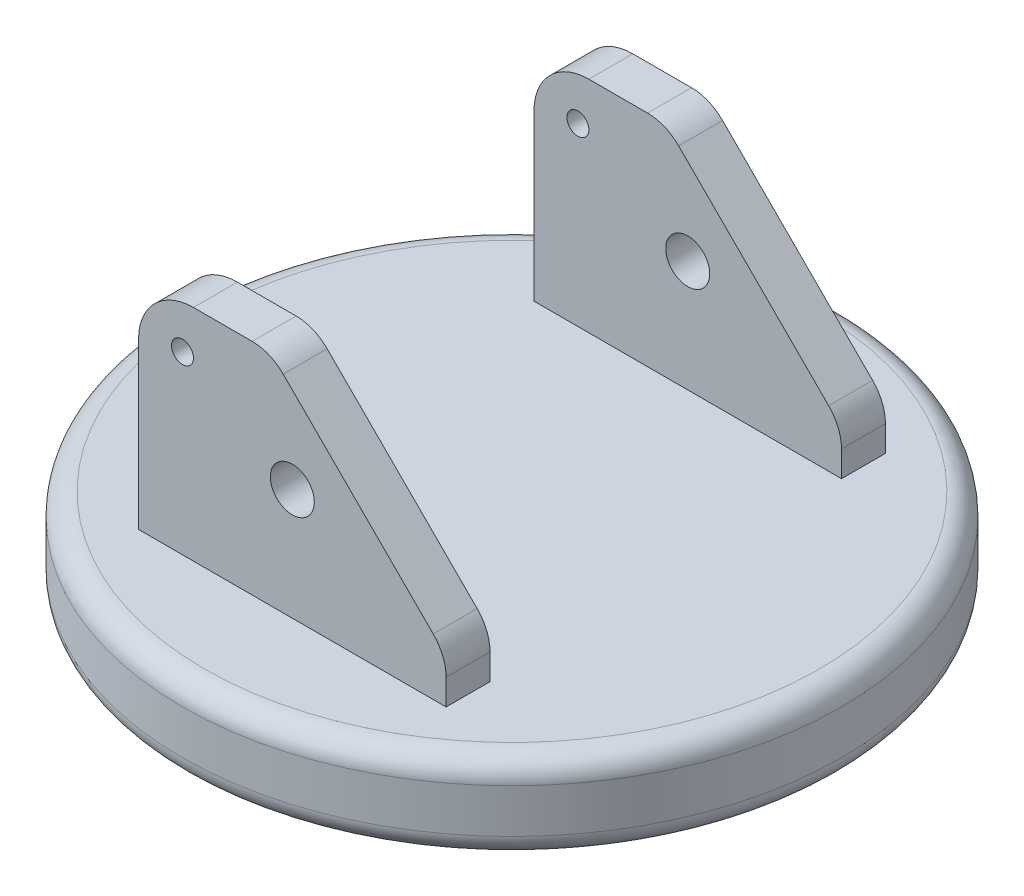
ISO-10303-21;
HEADER;
FILE_DESCRIPTION(('STEP AP214'),'2;1');
FILE_NAME('part.step','',(''),(''),'','','');
FILE_SCHEMA(('AUTOMOTIVE_DESIGN { 1 0 10303 214 1 1 1 1 }'));
ENDSEC;
DATA;
#1=APPLICATION_CONTEXT('core data for automotive mechanical design processes');
#2=APPLICATION_PROTOCOL_DEFINITION('international standard','automotive_design',2000,#1);
#3=PRODUCT_CONTEXT('',#1,'mechanical');
#4=PRODUCT('Part','Part','',(#3));
#5=PRODUCT_RELATED_PRODUCT_CATEGORY('part','',(#4));
#6=PRODUCT_DEFINITION_FORMATION('','',#4);
#7=PRODUCT_DEFINITION_CONTEXT('part definition',#1,'design');
#8=PRODUCT_DEFINITION('design','',#6,#7);
#9=PRODUCT_DEFINITION_SHAPE('','',#8);
#10=(LENGTH_UNIT() NAMED_UNIT(*) SI_UNIT(.MILLI.,.METRE.));
#11=(NAMED_UNIT(*) PLANE_ANGLE_UNIT() SI_UNIT($,.RADIAN.));
#12=(NAMED_UNIT(*) SI_UNIT($,.STERADIAN.) SOLID_ANGLE_UNIT());
#13=UNCERTAINTY_MEASURE_WITH_UNIT(LENGTH_MEASURE(1.E-05),#10,'distance_accuracy_value','');
#14=(GEOMETRIC_REPRESENTATION_CONTEXT(3) GLOBAL_UNCERTAINTY_ASSIGNED_CONTEXT((#13)) GLOBAL_UNIT_ASSIGNED_CONTEXT((#10,
#11,#12)) REPRESENTATION_CONTEXT('',''));
#15=CARTESIAN_POINT('',(0.,0.,0.));
#16=DIRECTION('',(0.,0.,1.));
#17=DIRECTION('',(1.,0.,0.));
#18=AXIS2_PLACEMENT_3D('',#15,#16,#17);
#19=CARTESIAN_POINT('',(0.,40.,0.));
#20=DIRECTION('',(0.,1.,0.));
#21=DIRECTION('',(0.,0.,1.));
#22=AXIS2_PLACEMENT_3D('',#19,#20,#21);
#23=PLANE('',#22);
#24=DIRECTION('',(-1.,0.,0.));
#25=VECTOR('',#24,1.);
#26=CARTESIAN_POINT('',(70.,40.,-100.));
#27=LINE('',#26,#25);
#28=CARTESIAN_POINT('',(70.,40.,-100.));
#29=VERTEX_POINT('',#28);
#30=CARTESIAN_POINT('',(-70.,40.,-100.));
#31=VERTEX_POINT('',#30);
#32=EDGE_CURVE('E195',#29,#31,#27,.T.);
#33=ORIENTED_EDGE('',*,*,#32,.F.);
#34=DIRECTION('',(0.,0.,-1.));
#35=VECTOR('',#34,1.);
#36=CARTESIAN_POINT('',(70.,40.,-100.));
#37=LINE('',#36,#35);
#38=CARTESIAN_POINT('',(70.,40.,-80.));
#39=VERTEX_POINT('',#38);
#40=EDGE_CURVE('E163',#39,#29,#37,.T.);
#41=ORIENTED_EDGE('',*,*,#40,.F.);
#42=DIRECTION('',(1.,0.,0.));
#43=VECTOR('',#42,1.);
#44=CARTESIAN_POINT('',(70.,40.,-80.));
#45=LINE('',#44,#43);
#46=CARTESIAN_POINT('',(-70.,40.,-80.));
#47=VERTEX_POINT('',#46);
#48=EDGE_CURVE('E201',#47,#39,#45,.T.);
#49=ORIENTED_EDGE('',*,*,#48,.F.);
#50=DIRECTION('',(0.,0.,1.));
#51=VECTOR('',#50,1.);
#52=CARTESIAN_POINT('',(-70.,40.,-100.));
#53=LINE('',#52,#51);
#54=EDGE_CURVE('E198',#31,#47,#53,.T.);
#55=ORIENTED_EDGE('',*,*,#54,.F.);
#56=EDGE_LOOP('',(#33,#41,#49,#55));
#57=FACE_BOUND('',#56,.T.);
#58=CARTESIAN_POINT('',(0.,40.,0.));
#59=DIRECTION('',(0.,1.,0.));
#60=DIRECTION('',(0.,0.,1.));
#61=AXIS2_PLACEMENT_3D('',#58,#59,#60);
#62=CIRCLE('',#61,140.);
#63=CARTESIAN_POINT('',(0.,40.,140.));
#64=VERTEX_POINT('',#63);
#65=EDGE_CURVE('E217',#64,#64,#62,.T.);
#66=ORIENTED_EDGE('',*,*,#65,.T.);
#67=EDGE_LOOP('',(#66));
#68=FACE_BOUND('',#67,.T.);
#69=DIRECTION('',(-1.,0.,0.));
#70=VECTOR('',#69,1.);
#71=CARTESIAN_POINT('',(70.,40.,80.));
#72=LINE('',#71,#70);
#73=CARTESIAN_POINT('',(70.,40.,80.));
#74=VERTEX_POINT('',#73);
#75=CARTESIAN_POINT('',(-70.,40.,80.));
#76=VERTEX_POINT('',#75);
#77=EDGE_CURVE('E157',#74,#76,#72,.T.);
#78=ORIENTED_EDGE('',*,*,#77,.F.);
#79=DIRECTION('',(0.,0.,-1.));
#80=VECTOR('',#79,1.);
#81=CARTESIAN_POINT('',(70.,40.,80.));
#82=LINE('',#81,#80);
#83=CARTESIAN_POINT('',(70.,40.,100.));
#84=VERTEX_POINT('',#83);
#85=EDGE_CURVE('E167',#84,#74,#82,.T.);
#86=ORIENTED_EDGE('',*,*,#85,.F.);
#87=DIRECTION('',(1.,0.,0.));
#88=VECTOR('',#87,1.);
#89=CARTESIAN_POINT('',(70.,40.,100.));
#90=LINE('',#89,#88);
#91=CARTESIAN_POINT('',(-70.,40.,100.));
#92=VERTEX_POINT('',#91);
#93=EDGE_CURVE('E179',#92,#84,#90,.T.);
#94=ORIENTED_EDGE('',*,*,#93,.F.);
#95=DIRECTION('',(0.,0.,1.));
#96=VECTOR('',#95,1.);
#97=CARTESIAN_POINT('',(-70.,40.,80.));
#98=LINE('',#97,#96);
#99=EDGE_CURVE('E177',#76,#92,#98,.T.);
#100=ORIENTED_EDGE('',*,*,#99,.F.);
#101=EDGE_LOOP('',(#78,#86,#94,#100));
#102=FACE_BOUND('',#101,.T.);
#103=ADVANCED_FACE('F37',(#57,#68,#102),#23,.T.);
#104=CARTESIAN_POINT('',(0.,40.,0.));
#105=DIRECTION('',(0.,-1.,0.));
#106=DIRECTION('',(0.,0.,-1.));
#107=AXIS2_PLACEMENT_3D('',#104,#105,#106);
#108=CYLINDRICAL_SURFACE('',#107,150.);
#109=CARTESIAN_POINT('',(0.,10.,0.));
#110=DIRECTION('',(0.,1.,0.));
#111=DIRECTION('',(0.,0.,1.));
#112=AXIS2_PLACEMENT_3D('',#109,#110,#111);
#113=CIRCLE('',#112,150.);
#114=CARTESIAN_POINT('',(0.,10.,150.));
#115=VERTEX_POINT('',#114);
#116=EDGE_CURVE('E223',#115,#115,#113,.T.);
#117=ORIENTED_EDGE('',*,*,#116,.T.);
#118=EDGE_LOOP('',(#117));
#119=FACE_BOUND('',#118,.T.);
#120=CARTESIAN_POINT('',(0.,30.,0.));
#121=DIRECTION('',(0.,1.,0.));
#122=DIRECTION('',(0.,0.,1.));
#123=AXIS2_PLACEMENT_3D('',#120,#121,#122);
#124=CIRCLE('',#123,150.);
#125=CARTESIAN_POINT('',(0.,30.,150.));
#126=VERTEX_POINT('',#125);
#127=EDGE_CURVE('E220',#126,#126,#124,.F.);
#128=ORIENTED_EDGE('',*,*,#127,.T.);
#129=EDGE_LOOP('',(#128));
#130=FACE_BOUND('',#129,.T.);
#131=ADVANCED_FACE('F39',(#119,#130),#108,.T.);
#132=CARTESIAN_POINT('',(0.,30.,0.));
#133=DIRECTION('',(0.,1.,0.));
#134=DIRECTION('',(0.,0.,1.));
#135=AXIS2_PLACEMENT_3D('',#132,#133,#134);
#136=TOROIDAL_SURFACE('',#135,140.,10.);
#137=ORIENTED_EDGE('',*,*,#127,.F.);
#138=EDGE_LOOP('',(#137));
#139=FACE_BOUND('',#138,.T.);
#140=ORIENTED_EDGE('',*,*,#65,.F.);
#141=EDGE_LOOP('',(#140));
#142=FACE_BOUND('',#141,.T.);
#143=ADVANCED_FACE('F329',(#139,#142),#136,.T.);
#144=CARTESIAN_POINT('',(0.,10.,0.));
#145=DIRECTION('',(0.,1.,0.));
#146=DIRECTION('',(0.,0.,1.));
#147=AXIS2_PLACEMENT_3D('',#144,#145,#146);
#148=TOROIDAL_SURFACE('',#147,140.,10.);
#149=CARTESIAN_POINT('',(0.,0.,0.));
#150=DIRECTION('',(0.,1.,0.));
#151=DIRECTION('',(0.,0.,1.));
#152=AXIS2_PLACEMENT_3D('',#149,#150,#151);
#153=CIRCLE('',#152,140.);
#154=CARTESIAN_POINT('',(0.,0.,140.));
#155=VERTEX_POINT('',#154);
#156=EDGE_CURVE('E617',#155,#155,#153,.T.);
#157=ORIENTED_EDGE('',*,*,#156,.T.);
#158=EDGE_LOOP('',(#157));
#159=FACE_BOUND('',#158,.T.);
#160=ORIENTED_EDGE('',*,*,#116,.F.);
#161=EDGE_LOOP('',(#160));
#162=FACE_BOUND('',#161,.T.);
#163=ADVANCED_FACE('F336',(#159,#162),#148,.T.);
#164=CARTESIAN_POINT('',(70.,140.,-100.));
#165=DIRECTION('',(-1.,0.,0.));
#166=DIRECTION('',(0.,0.,1.));
#167=AXIS2_PLACEMENT_3D('',#164,#165,#166);
#168=PLANE('',#167);
#169=DIRECTION('',(0.,-1.,0.));
#170=VECTOR('',#169,1.);
#171=CARTESIAN_POINT('',(70.,140.,-100.));
#172=LINE('',#171,#170);
#173=CARTESIAN_POINT('',(70.,51.7157287525379,-100.));
#174=VERTEX_POINT('',#173);
#175=EDGE_CURVE('E215',#174,#29,#172,.T.);
#176=ORIENTED_EDGE('',*,*,#175,.F.);
#177=DIRECTION('',(0.,0.,-1.));
#178=VECTOR('',#177,1.);
#179=CARTESIAN_POINT('',(70.,51.7157287525379,-80.));
#180=LINE('',#179,#178);
#181=CARTESIAN_POINT('',(70.,51.7157287525379,-80.));
#182=VERTEX_POINT('',#181);
#183=EDGE_CURVE('E282',#174,#182,#180,.F.);
#184=ORIENTED_EDGE('',*,*,#183,.T.);
#185=DIRECTION('',(0.,-1.,0.));
#186=VECTOR('',#185,1.);
#187=CARTESIAN_POINT('',(70.,140.,-80.));
#188=LINE('',#187,#186);
#189=EDGE_CURVE('E209',#182,#39,#188,.T.);
#190=ORIENTED_EDGE('',*,*,#189,.T.);
#191=ORIENTED_EDGE('',*,*,#40,.T.);
#192=EDGE_LOOP('',(#176,#184,#190,#191));
#193=FACE_BOUND('',#192,.T.);
#194=ADVANCED_FACE('F340',(#193),#168,.F.);
#195=CARTESIAN_POINT('',(70.,140.,-100.));
#196=DIRECTION('',(0.,0.,1.));
#197=DIRECTION('',(1.,0.,0.));
#198=AXIS2_PLACEMENT_3D('',#195,#196,#197);
#199=PLANE('',#198);
#200=CARTESIAN_POINT('',(-50.,120.,-100.));
#201=DIRECTION('',(0.,0.,-1.));
#202=DIRECTION('',(-1.,0.,0.));
#203=AXIS2_PLACEMENT_3D('',#200,#201,#202);
#204=CIRCLE('',#203,5.);
#205=CARTESIAN_POINT('',(-55.,120.,-100.));
#206=VERTEX_POINT('',#205);
#207=EDGE_CURVE('E256',#206,#206,#204,.T.);
#208=ORIENTED_EDGE('',*,*,#207,.F.);
#209=EDGE_LOOP('',(#208));
#210=FACE_BOUND('',#209,.T.);
#211=CARTESIAN_POINT('',(0.,90.7468879668057,-100.));
#212=DIRECTION('',(0.,0.,1.));
#213=DIRECTION('',(1.,0.,0.));
#214=AXIS2_PLACEMENT_3D('',#211,#212,#213);
#215=CIRCLE('',#214,10.);
#216=CARTESIAN_POINT('',(10.,90.7468879668057,-100.));
#217=VERTEX_POINT('',#216);
#218=EDGE_CURVE('E174',#217,#217,#215,.T.);
#219=ORIENTED_EDGE('',*,*,#218,.T.);
#220=EDGE_LOOP('',(#219));
#221=FACE_BOUND('',#220,.T.);
#222=DIRECTION('',(-1.,0.,0.));
#223=VECTOR('',#222,1.);
#224=CARTESIAN_POINT('',(70.,140.,-100.));
#225=LINE('',#224,#223);
#226=CARTESIAN_POINT('',(-18.2842712474619,140.,-100.));
#227=VERTEX_POINT('',#226);
#228=CARTESIAN_POINT('',(-45.,140.,-100.));
#229=VERTEX_POINT('',#228);
#230=EDGE_CURVE('E204',#227,#229,#225,.T.);
#231=ORIENTED_EDGE('',*,*,#230,.F.);
#232=CARTESIAN_POINT('',(-18.2842712474619,120.,-100.));
#233=DIRECTION('',(0.,0.,1.));
#234=DIRECTION('',(1.,0.,0.));
#235=AXIS2_PLACEMENT_3D('',#232,#233,#234);
#236=CIRCLE('',#235,20.);
#237=CARTESIAN_POINT('',(-4.14213562373096,134.142135623731,-100.));
#238=VERTEX_POINT('',#237);
#239=EDGE_CURVE('E272',#227,#238,#236,.F.);
#240=ORIENTED_EDGE('',*,*,#239,.T.);
#241=DIRECTION('',(-0.707106781186547,0.707106781186548,0.));
#242=VECTOR('',#241,1.);
#243=CARTESIAN_POINT('',(-10.,140.,-100.));
#244=LINE('',#243,#242);
#245=CARTESIAN_POINT('',(64.142135623731,65.8578643762688,-100.));
#246=VERTEX_POINT('',#245);
#247=EDGE_CURVE('E251',#238,#246,#244,.F.);
#248=ORIENTED_EDGE('',*,*,#247,.T.);
#249=CARTESIAN_POINT('',(50.,51.7157287525379,-100.));
#250=DIRECTION('',(0.,0.,1.));
#251=DIRECTION('',(1.,0.,0.));
#252=AXIS2_PLACEMENT_3D('',#249,#250,#251);
#253=CIRCLE('',#252,20.);
#254=EDGE_CURVE('E270',#246,#174,#253,.F.);
#255=ORIENTED_EDGE('',*,*,#254,.T.);
#256=ORIENTED_EDGE('',*,*,#175,.T.);
#257=ORIENTED_EDGE('',*,*,#32,.T.);
#258=DIRECTION('',(0.,-1.,0.));
#259=VECTOR('',#258,1.);
#260=CARTESIAN_POINT('',(-70.,140.,-100.));
#261=LINE('',#260,#259);
#262=CARTESIAN_POINT('',(-70.,115.,-100.));
#263=VERTEX_POINT('',#262);
#264=EDGE_CURVE('E213',#263,#31,#261,.T.);
#265=ORIENTED_EDGE('',*,*,#264,.F.);
#266=CARTESIAN_POINT('',(-45.,115.,-100.));
#267=DIRECTION('',(0.,0.,1.));
#268=DIRECTION('',(1.,0.,0.));
#269=AXIS2_PLACEMENT_3D('',#266,#267,#268);
#270=CIRCLE('',#269,25.);
#271=EDGE_CURVE('E248',#263,#229,#270,.F.);
#272=ORIENTED_EDGE('',*,*,#271,.T.);
#273=EDGE_LOOP('',(#231,#240,#248,#255,#256,#257,#265,#272));
#274=FACE_BOUND('',#273,.T.);
#275=ADVANCED_FACE('F344',(#210,#221,#274),#199,.F.);
#276=CARTESIAN_POINT('',(-70.,140.,-100.));
#277=DIRECTION('',(1.,0.,0.));
#278=DIRECTION('',(0.,0.,-1.));
#279=AXIS2_PLACEMENT_3D('',#276,#277,#278);
#280=PLANE('',#279);
#281=DIRECTION('',(0.,-1.,0.));
#282=VECTOR('',#281,1.);
#283=CARTESIAN_POINT('',(-70.,140.,-80.));
#284=LINE('',#283,#282);
#285=CARTESIAN_POINT('',(-70.,115.,-80.));
#286=VERTEX_POINT('',#285);
#287=EDGE_CURVE('E211',#286,#47,#284,.T.);
#288=ORIENTED_EDGE('',*,*,#287,.F.);
#289=DIRECTION('',(0.,0.,1.));
#290=VECTOR('',#289,1.);
#291=CARTESIAN_POINT('',(-70.,115.,-100.));
#292=LINE('',#291,#290);
#293=EDGE_CURVE('E246',#286,#263,#292,.F.);
#294=ORIENTED_EDGE('',*,*,#293,.T.);
#295=ORIENTED_EDGE('',*,*,#264,.T.);
#296=ORIENTED_EDGE('',*,*,#54,.T.);
#297=EDGE_LOOP('',(#288,#294,#295,#296));
#298=FACE_BOUND('',#297,.T.);
#299=ADVANCED_FACE('F348',(#298),#280,.F.);
#300=CARTESIAN_POINT('',(70.,140.,-80.));
#301=DIRECTION('',(0.,0.,-1.));
#302=DIRECTION('',(-1.,0.,0.));
#303=AXIS2_PLACEMENT_3D('',#300,#301,#302);
#304=PLANE('',#303);
#305=CARTESIAN_POINT('',(-50.,120.,-80.));
#306=DIRECTION('',(0.,0.,-1.));
#307=DIRECTION('',(-1.,0.,0.));
#308=AXIS2_PLACEMENT_3D('',#305,#306,#307);
#309=CIRCLE('',#308,5.);
#310=CARTESIAN_POINT('',(-55.,120.,-80.));
#311=VERTEX_POINT('',#310);
#312=EDGE_CURVE('E231',#311,#311,#309,.T.);
#313=ORIENTED_EDGE('',*,*,#312,.T.);
#314=EDGE_LOOP('',(#313));
#315=FACE_BOUND('',#314,.T.);
#316=CARTESIAN_POINT('',(0.,90.7468879668057,-80.));
#317=DIRECTION('',(0.,0.,-1.));
#318=DIRECTION('',(-1.,0.,0.));
#319=AXIS2_PLACEMENT_3D('',#316,#317,#318);
#320=CIRCLE('',#319,10.);
#321=CARTESIAN_POINT('',(-10.,90.7468879668057,-80.));
#322=VERTEX_POINT('',#321);
#323=EDGE_CURVE('E602',#322,#322,#320,.T.);
#324=ORIENTED_EDGE('',*,*,#323,.T.);
#325=EDGE_LOOP('',(#324));
#326=FACE_BOUND('',#325,.T.);
#327=DIRECTION('',(0.707106781186547,-0.707106781186548,0.));
#328=VECTOR('',#327,1.);
#329=CARTESIAN_POINT('',(-10.,140.,-80.));
#330=LINE('',#329,#328);
#331=CARTESIAN_POINT('',(64.142135623731,65.8578643762688,-80.));
#332=VERTEX_POINT('',#331);
#333=CARTESIAN_POINT('',(-4.14213562373096,134.142135623731,-80.));
#334=VERTEX_POINT('',#333);
#335=EDGE_CURVE('E259',#332,#334,#330,.F.);
#336=ORIENTED_EDGE('',*,*,#335,.T.);
#337=CARTESIAN_POINT('',(-18.2842712474619,120.,-80.));
#338=DIRECTION('',(0.,0.,-1.));
#339=DIRECTION('',(-1.,0.,0.));
#340=AXIS2_PLACEMENT_3D('',#337,#338,#339);
#341=CIRCLE('',#340,20.);
#342=CARTESIAN_POINT('',(-18.2842712474619,140.,-80.));
#343=VERTEX_POINT('',#342);
#344=EDGE_CURVE('E280',#334,#343,#341,.F.);
#345=ORIENTED_EDGE('',*,*,#344,.T.);
#346=DIRECTION('',(1.,0.,0.));
#347=VECTOR('',#346,1.);
#348=CARTESIAN_POINT('',(70.,140.,-80.));
#349=LINE('',#348,#347);
#350=CARTESIAN_POINT('',(-45.,140.,-80.));
#351=VERTEX_POINT('',#350);
#352=EDGE_CURVE('E206',#351,#343,#349,.T.);
#353=ORIENTED_EDGE('',*,*,#352,.F.);
#354=CARTESIAN_POINT('',(-45.,115.,-80.));
#355=DIRECTION('',(0.,0.,-1.));
#356=DIRECTION('',(-1.,0.,0.));
#357=AXIS2_PLACEMENT_3D('',#354,#355,#356);
#358=CIRCLE('',#357,25.);
#359=EDGE_CURVE('E244',#351,#286,#358,.F.);
#360=ORIENTED_EDGE('',*,*,#359,.T.);
#361=ORIENTED_EDGE('',*,*,#287,.T.);
#362=ORIENTED_EDGE('',*,*,#48,.T.);
#363=ORIENTED_EDGE('',*,*,#189,.F.);
#364=CARTESIAN_POINT('',(50.,51.7157287525379,-80.));
#365=DIRECTION('',(0.,0.,-1.));
#366=DIRECTION('',(-1.,0.,0.));
#367=AXIS2_PLACEMENT_3D('',#364,#365,#366);
#368=CIRCLE('',#367,20.);
#369=EDGE_CURVE('E278',#182,#332,#368,.F.);
#370=ORIENTED_EDGE('',*,*,#369,.T.);
#371=EDGE_LOOP('',(#336,#345,#353,#360,#361,#362,#363,#370));
#372=FACE_BOUND('',#371,.T.);
#373=ADVANCED_FACE('F352',(#315,#326,#372),#304,.F.);
#374=CARTESIAN_POINT('',(70.,140.,-80.));
#375=DIRECTION('',(0.,-1.,0.));
#376=DIRECTION('',(0.,0.,-1.));
#377=AXIS2_PLACEMENT_3D('',#374,#375,#376);
#378=PLANE('',#377);
#379=ORIENTED_EDGE('',*,*,#352,.T.);
#380=DIRECTION('',(0.,0.,1.));
#381=VECTOR('',#380,1.);
#382=CARTESIAN_POINT('',(-18.2842712474619,140.,-100.));
#383=LINE('',#382,#381);
#384=EDGE_CURVE('E267',#343,#227,#383,.F.);
#385=ORIENTED_EDGE('',*,*,#384,.T.);
#386=ORIENTED_EDGE('',*,*,#230,.T.);
#387=DIRECTION('',(0.,0.,1.));
#388=VECTOR('',#387,1.);
#389=CARTESIAN_POINT('',(-45.,140.,-80.));
#390=LINE('',#389,#388);
#391=EDGE_CURVE('E241',#229,#351,#390,.T.);
#392=ORIENTED_EDGE('',*,*,#391,.T.);
#393=EDGE_LOOP('',(#379,#385,#386,#392));
#394=FACE_BOUND('',#393,.T.);
#395=ADVANCED_FACE('F356',(#394),#378,.F.);
#396=CARTESIAN_POINT('',(70.,140.,80.));
#397=DIRECTION('',(-1.,0.,0.));
#398=DIRECTION('',(0.,0.,1.));
#399=AXIS2_PLACEMENT_3D('',#396,#397,#398);
#400=PLANE('',#399);
#401=DIRECTION('',(0.,-1.,0.));
#402=VECTOR('',#401,1.);
#403=CARTESIAN_POINT('',(70.,140.,80.));
#404=LINE('',#403,#402);
#405=CARTESIAN_POINT('',(70.,51.7157287525379,80.));
#406=VERTEX_POINT('',#405);
#407=EDGE_CURVE('E152',#406,#74,#404,.T.);
#408=ORIENTED_EDGE('',*,*,#407,.F.);
#409=DIRECTION('',(0.,0.,-1.));
#410=VECTOR('',#409,1.);
#411=CARTESIAN_POINT('',(70.,51.7157287525379,100.));
#412=LINE('',#411,#410);
#413=CARTESIAN_POINT('',(70.,51.7157287525379,100.));
#414=VERTEX_POINT('',#413);
#415=EDGE_CURVE('E285',#406,#414,#412,.F.);
#416=ORIENTED_EDGE('',*,*,#415,.T.);
#417=DIRECTION('',(0.,-1.,0.));
#418=VECTOR('',#417,1.);
#419=CARTESIAN_POINT('',(70.,140.,100.));
#420=LINE('',#419,#418);
#421=EDGE_CURVE('E170',#414,#84,#420,.T.);
#422=ORIENTED_EDGE('',*,*,#421,.T.);
#423=ORIENTED_EDGE('',*,*,#85,.T.);
#424=EDGE_LOOP('',(#408,#416,#422,#423));
#425=FACE_BOUND('',#424,.T.);
#426=ADVANCED_FACE('F168',(#425),#400,.F.);
#427=CARTESIAN_POINT('',(70.,140.,80.));
#428=DIRECTION('',(0.,0.,1.));
#429=DIRECTION('',(1.,0.,0.));
#430=AXIS2_PLACEMENT_3D('',#427,#428,#429);
#431=PLANE('',#430);
#432=CARTESIAN_POINT('',(-50.,120.,80.));
#433=DIRECTION('',(0.,0.,1.));
#434=DIRECTION('',(1.,0.,0.));
#435=AXIS2_PLACEMENT_3D('',#432,#433,#434);
#436=CIRCLE('',#435,5.);
#437=CARTESIAN_POINT('',(-45.,120.,80.));
#438=VERTEX_POINT('',#437);
#439=EDGE_CURVE('E255',#438,#438,#436,.T.);
#440=ORIENTED_EDGE('',*,*,#439,.T.);
#441=EDGE_LOOP('',(#440));
#442=FACE_BOUND('',#441,.T.);
#443=CARTESIAN_POINT('',(0.,90.7468879668057,80.));
#444=DIRECTION('',(0.,0.,1.));
#445=DIRECTION('',(1.,0.,0.));
#446=AXIS2_PLACEMENT_3D('',#443,#444,#445);
#447=CIRCLE('',#446,10.);
#448=CARTESIAN_POINT('',(10.,90.7468879668057,80.));
#449=VERTEX_POINT('',#448);
#450=EDGE_CURVE('E230',#449,#449,#447,.T.);
#451=ORIENTED_EDGE('',*,*,#450,.T.);
#452=EDGE_LOOP('',(#451));
#453=FACE_BOUND('',#452,.T.);
#454=DIRECTION('',(-0.707106781186547,0.707106781186548,0.));
#455=VECTOR('',#454,1.);
#456=CARTESIAN_POINT('',(-10.,140.,80.));
#457=LINE('',#456,#455);
#458=CARTESIAN_POINT('',(-4.14213562373096,134.142135623731,80.));
#459=VERTEX_POINT('',#458);
#460=CARTESIAN_POINT('',(64.142135623731,65.8578643762688,80.));
#461=VERTEX_POINT('',#460);
#462=EDGE_CURVE('E262',#459,#461,#457,.F.);
#463=ORIENTED_EDGE('',*,*,#462,.T.);
#464=CARTESIAN_POINT('',(50.,51.7157287525379,80.));
#465=DIRECTION('',(0.,0.,1.));
#466=DIRECTION('',(1.,0.,0.));
#467=AXIS2_PLACEMENT_3D('',#464,#465,#466);
#468=CIRCLE('',#467,20.);
#469=EDGE_CURVE('E45',#461,#406,#468,.F.);
#470=ORIENTED_EDGE('',*,*,#469,.T.);
#471=ORIENTED_EDGE('',*,*,#407,.T.);
#472=ORIENTED_EDGE('',*,*,#77,.T.);
#473=DIRECTION('',(0.,-1.,0.));
#474=VECTOR('',#473,1.);
#475=CARTESIAN_POINT('',(-70.,140.,80.));
#476=LINE('',#475,#474);
#477=CARTESIAN_POINT('',(-70.,115.,80.));
#478=VERTEX_POINT('',#477);
#479=EDGE_CURVE('E164',#478,#76,#476,.T.);
#480=ORIENTED_EDGE('',*,*,#479,.F.);
#481=CARTESIAN_POINT('',(-45.,115.,80.));
#482=DIRECTION('',(0.,0.,1.));
#483=DIRECTION('',(1.,0.,0.));
#484=AXIS2_PLACEMENT_3D('',#481,#482,#483);
#485=CIRCLE('',#484,25.);
#486=CARTESIAN_POINT('',(-45.,140.,80.));
#487=VERTEX_POINT('',#486);
#488=EDGE_CURVE('E238',#478,#487,#485,.F.);
#489=ORIENTED_EDGE('',*,*,#488,.T.);
#490=DIRECTION('',(-1.,0.,0.));
#491=VECTOR('',#490,1.);
#492=CARTESIAN_POINT('',(70.,140.,80.));
#493=LINE('',#492,#491);
#494=CARTESIAN_POINT('',(-18.2842712474619,140.,80.));
#495=VERTEX_POINT('',#494);
#496=EDGE_CURVE('E184',#495,#487,#493,.T.);
#497=ORIENTED_EDGE('',*,*,#496,.F.);
#498=CARTESIAN_POINT('',(-18.2842712474619,120.,80.));
#499=DIRECTION('',(0.,0.,1.));
#500=DIRECTION('',(1.,0.,0.));
#501=AXIS2_PLACEMENT_3D('',#498,#499,#500);
#502=CIRCLE('',#501,20.);
#503=EDGE_CURVE('E52',#495,#459,#502,.F.);
#504=ORIENTED_EDGE('',*,*,#503,.T.);
#505=EDGE_LOOP('',(#463,#470,#471,#472,#480,#489,#497,#504));
#506=FACE_BOUND('',#505,.T.);
#507=ADVANCED_FACE('F154',(#442,#453,#506),#431,.F.);
#508=CARTESIAN_POINT('',(-70.,140.,80.));
#509=DIRECTION('',(1.,0.,0.));
#510=DIRECTION('',(0.,0.,-1.));
#511=AXIS2_PLACEMENT_3D('',#508,#509,#510);
#512=PLANE('',#511);
#513=DIRECTION('',(0.,-1.,0.));
#514=VECTOR('',#513,1.);
#515=CARTESIAN_POINT('',(-70.,140.,100.));
#516=LINE('',#515,#514);
#517=CARTESIAN_POINT('',(-70.,115.,100.));
#518=VERTEX_POINT('',#517);
#519=EDGE_CURVE('E190',#518,#92,#516,.T.);
#520=ORIENTED_EDGE('',*,*,#519,.F.);
#521=DIRECTION('',(0.,0.,1.));
#522=VECTOR('',#521,1.);
#523=CARTESIAN_POINT('',(-70.,115.,80.));
#524=LINE('',#523,#522);
#525=EDGE_CURVE('E236',#518,#478,#524,.F.);
#526=ORIENTED_EDGE('',*,*,#525,.T.);
#527=ORIENTED_EDGE('',*,*,#479,.T.);
#528=ORIENTED_EDGE('',*,*,#99,.T.);
#529=EDGE_LOOP('',(#520,#526,#527,#528));
#530=FACE_BOUND('',#529,.T.);
#531=ADVANCED_FACE('F310',(#530),#512,.F.);
#532=CARTESIAN_POINT('',(70.,140.,100.));
#533=DIRECTION('',(0.,0.,-1.));
#534=DIRECTION('',(-1.,0.,0.));
#535=AXIS2_PLACEMENT_3D('',#532,#533,#534);
#536=PLANE('',#535);
#537=CARTESIAN_POINT('',(-50.,120.,100.));
#538=DIRECTION('',(0.,0.,-1.));
#539=DIRECTION('',(-1.,0.,0.));
#540=AXIS2_PLACEMENT_3D('',#537,#538,#539);
#541=CIRCLE('',#540,5.);
#542=CARTESIAN_POINT('',(-55.,120.,100.));
#543=VERTEX_POINT('',#542);
#544=EDGE_CURVE('E252',#543,#543,#541,.T.);
#545=ORIENTED_EDGE('',*,*,#544,.T.);
#546=EDGE_LOOP('',(#545));
#547=FACE_BOUND('',#546,.T.);
#548=CARTESIAN_POINT('',(0.,90.7468879668057,100.));
#549=DIRECTION('',(0.,0.,-1.));
#550=DIRECTION('',(-1.,0.,0.));
#551=AXIS2_PLACEMENT_3D('',#548,#549,#550);
#552=CIRCLE('',#551,10.);
#553=CARTESIAN_POINT('',(-10.,90.7468879668057,100.));
#554=VERTEX_POINT('',#553);
#555=EDGE_CURVE('E227',#554,#554,#552,.T.);
#556=ORIENTED_EDGE('',*,*,#555,.T.);
#557=EDGE_LOOP('',(#556));
#558=FACE_BOUND('',#557,.T.);
#559=ORIENTED_EDGE('',*,*,#421,.F.);
#560=CARTESIAN_POINT('',(50.,51.7157287525379,100.));
#561=DIRECTION('',(0.,0.,-1.));
#562=DIRECTION('',(-1.,0.,0.));
#563=AXIS2_PLACEMENT_3D('',#560,#561,#562);
#564=CIRCLE('',#563,20.);
#565=CARTESIAN_POINT('',(64.142135623731,65.8578643762688,100.));
#566=VERTEX_POINT('',#565);
#567=EDGE_CURVE('E289',#414,#566,#564,.F.);
#568=ORIENTED_EDGE('',*,*,#567,.T.);
#569=DIRECTION('',(0.707106781186547,-0.707106781186548,0.));
#570=VECTOR('',#569,1.);
#571=CARTESIAN_POINT('',(-10.,140.,100.));
#572=LINE('',#571,#570);
#573=CARTESIAN_POINT('',(-4.14213562373096,134.142135623731,100.));
#574=VERTEX_POINT('',#573);
#575=EDGE_CURVE('E264',#566,#574,#572,.F.);
#576=ORIENTED_EDGE('',*,*,#575,.T.);
#577=CARTESIAN_POINT('',(-18.2842712474619,120.,100.));
#578=DIRECTION('',(0.,0.,-1.));
#579=DIRECTION('',(-1.,0.,0.));
#580=AXIS2_PLACEMENT_3D('',#577,#578,#579);
#581=CIRCLE('',#580,20.);
#582=CARTESIAN_POINT('',(-18.2842712474619,140.,100.));
#583=VERTEX_POINT('',#582);
#584=EDGE_CURVE('E287',#574,#583,#581,.F.);
#585=ORIENTED_EDGE('',*,*,#584,.T.);
#586=DIRECTION('',(1.,0.,0.));
#587=VECTOR('',#586,1.);
#588=CARTESIAN_POINT('',(70.,140.,100.));
#589=LINE('',#588,#587);
#590=CARTESIAN_POINT('',(-45.,140.,100.));
#591=VERTEX_POINT('',#590);
#592=EDGE_CURVE('E186',#591,#583,#589,.T.);
#593=ORIENTED_EDGE('',*,*,#592,.F.);
#594=CARTESIAN_POINT('',(-45.,115.,100.));
#595=DIRECTION('',(0.,0.,-1.));
#596=DIRECTION('',(-1.,0.,0.));
#597=AXIS2_PLACEMENT_3D('',#594,#595,#596);
#598=CIRCLE('',#597,25.);
#599=EDGE_CURVE('E234',#591,#518,#598,.F.);
#600=ORIENTED_EDGE('',*,*,#599,.T.);
#601=ORIENTED_EDGE('',*,*,#519,.T.);
#602=ORIENTED_EDGE('',*,*,#93,.T.);
#603=EDGE_LOOP('',(#559,#568,#576,#585,#593,#600,#601,#602));
#604=FACE_BOUND('',#603,.T.);
#605=ADVANCED_FACE('F300',(#547,#558,#604),#536,.F.);
#606=CARTESIAN_POINT('',(70.,140.,100.));
#607=DIRECTION('',(0.,-1.,0.));
#608=DIRECTION('',(0.,0.,-1.));
#609=AXIS2_PLACEMENT_3D('',#606,#607,#608);
#610=PLANE('',#609);
#611=ORIENTED_EDGE('',*,*,#592,.T.);
#612=DIRECTION('',(0.,0.,1.));
#613=VECTOR('',#612,1.);
#614=CARTESIAN_POINT('',(-18.2842712474619,140.,80.));
#615=LINE('',#614,#613);
#616=EDGE_CURVE('E11',#583,#495,#615,.F.);
#617=ORIENTED_EDGE('',*,*,#616,.T.);
#618=ORIENTED_EDGE('',*,*,#496,.T.);
#619=DIRECTION('',(0.,0.,1.));
#620=VECTOR('',#619,1.);
#621=CARTESIAN_POINT('',(-45.,140.,100.));
#622=LINE('',#621,#620);
#623=EDGE_CURVE('E226',#487,#591,#622,.T.);
#624=ORIENTED_EDGE('',*,*,#623,.T.);
#625=EDGE_LOOP('',(#611,#617,#618,#624));
#626=FACE_BOUND('',#625,.T.);
#627=ADVANCED_FACE('F302',(#626),#610,.F.);
#628=CARTESIAN_POINT('',(0.,90.7468879668057,-150.));
#629=DIRECTION('',(0.,0.,1.));
#630=DIRECTION('',(1.,0.,0.));
#631=AXIS2_PLACEMENT_3D('',#628,#629,#630);
#632=CYLINDRICAL_SURFACE('',#631,10.);
#633=ORIENTED_EDGE('',*,*,#555,.F.);
#634=EDGE_LOOP('',(#633));
#635=FACE_BOUND('',#634,.T.);
#636=ORIENTED_EDGE('',*,*,#450,.F.);
#637=EDGE_LOOP('',(#636));
#638=FACE_BOUND('',#637,.T.);
#639=ADVANCED_FACE('F373',(#635,#638),#632,.F.);
#640=ORIENTED_EDGE('',*,*,#323,.F.);
#641=EDGE_LOOP('',(#640));
#642=FACE_BOUND('',#641,.T.);
#643=ORIENTED_EDGE('',*,*,#218,.F.);
#644=EDGE_LOOP('',(#643));
#645=FACE_BOUND('',#644,.T.);
#646=ADVANCED_FACE('F374',(#642,#645),#632,.F.);
#647=CARTESIAN_POINT('',(-45.,115.,100.));
#648=DIRECTION('',(0.,0.,1.));
#649=DIRECTION('',(1.,0.,0.));
#650=AXIS2_PLACEMENT_3D('',#647,#648,#649);
#651=CYLINDRICAL_SURFACE('',#650,25.);
#652=ORIENTED_EDGE('',*,*,#488,.F.);
#653=ORIENTED_EDGE('',*,*,#525,.F.);
#654=ORIENTED_EDGE('',*,*,#599,.F.);
#655=ORIENTED_EDGE('',*,*,#623,.F.);
#656=EDGE_LOOP('',(#652,#653,#654,#655));
#657=FACE_BOUND('',#656,.T.);
#658=ADVANCED_FACE('F306',(#657),#651,.T.);
#659=CARTESIAN_POINT('',(-45.,115.,-80.));
#660=DIRECTION('',(0.,0.,1.));
#661=DIRECTION('',(1.,0.,0.));
#662=AXIS2_PLACEMENT_3D('',#659,#660,#661);
#663=CYLINDRICAL_SURFACE('',#662,25.);
#664=ORIENTED_EDGE('',*,*,#271,.F.);
#665=ORIENTED_EDGE('',*,*,#293,.F.);
#666=ORIENTED_EDGE('',*,*,#359,.F.);
#667=ORIENTED_EDGE('',*,*,#391,.F.);
#668=EDGE_LOOP('',(#664,#665,#666,#667));
#669=FACE_BOUND('',#668,.T.);
#670=ADVANCED_FACE('F380',(#669),#663,.T.);
#671=CARTESIAN_POINT('',(-50.,120.,150.));
#672=DIRECTION('',(0.,0.,-1.));
#673=DIRECTION('',(-1.,0.,0.));
#674=AXIS2_PLACEMENT_3D('',#671,#672,#673);
#675=CYLINDRICAL_SURFACE('',#674,5.);
#676=ORIENTED_EDGE('',*,*,#544,.F.);
#677=EDGE_LOOP('',(#676));
#678=FACE_BOUND('',#677,.T.);
#679=ORIENTED_EDGE('',*,*,#439,.F.);
#680=EDGE_LOOP('',(#679));
#681=FACE_BOUND('',#680,.T.);
#682=ADVANCED_FACE('F383',(#678,#681),#675,.F.);
#683=ORIENTED_EDGE('',*,*,#207,.T.);
#684=EDGE_LOOP('',(#683));
#685=FACE_BOUND('',#684,.T.);
#686=ORIENTED_EDGE('',*,*,#312,.F.);
#687=EDGE_LOOP('',(#686));
#688=FACE_BOUND('',#687,.T.);
#689=ADVANCED_FACE('F385',(#685,#688),#675,.F.);
#690=CARTESIAN_POINT('',(0.,30.,0.));
#691=DIRECTION('',(0.,1.,0.));
#692=DIRECTION('',(0.,0.,1.));
#693=AXIS2_PLACEMENT_3D('',#690,#691,#692);
#694=PLANE('',#693);
#695=CARTESIAN_POINT('',(0.,30.,0.));
#696=DIRECTION('',(0.,1.,0.));
#697=DIRECTION('',(0.,0.,1.));
#698=AXIS2_PLACEMENT_3D('',#695,#696,#697);
#699=CIRCLE('',#698,140.);
#700=CARTESIAN_POINT('',(0.,30.,140.));
#701=VERTEX_POINT('',#700);
#702=EDGE_CURVE('E620',#701,#701,#699,.T.);
#703=ORIENTED_EDGE('',*,*,#702,.F.);
#704=EDGE_LOOP('',(#703));
#705=FACE_BOUND('',#704,.T.);
#706=ADVANCED_FACE('F388',(#705),#694,.F.);
#707=CARTESIAN_POINT('',(0.,40.,0.));
#708=DIRECTION('',(0.,-1.,0.));
#709=DIRECTION('',(0.,0.,-1.));
#710=AXIS2_PLACEMENT_3D('',#707,#708,#709);
#711=CYLINDRICAL_SURFACE('',#710,140.);
#712=ORIENTED_EDGE('',*,*,#156,.F.);
#713=EDGE_LOOP('',(#712));
#714=FACE_BOUND('',#713,.T.);
#715=ORIENTED_EDGE('',*,*,#702,.T.);
#716=EDGE_LOOP('',(#715));
#717=FACE_BOUND('',#716,.T.);
#718=ADVANCED_FACE('F390',(#714,#717),#711,.F.);
#719=CARTESIAN_POINT('',(-10.,140.,-80.));
#720=DIRECTION('',(-0.707106781186548,-0.707106781186547,0.));
#721=DIRECTION('',(0.707106781186547,-0.707106781186548,0.));
#722=AXIS2_PLACEMENT_3D('',#719,#720,#721);
#723=PLANE('',#722);
#724=ORIENTED_EDGE('',*,*,#247,.F.);
#725=DIRECTION('',(0.,0.,-1.));
#726=VECTOR('',#725,1.);
#727=CARTESIAN_POINT('',(-4.14213562373096,134.142135623731,-80.));
#728=LINE('',#727,#726);
#729=EDGE_CURVE('E276',#238,#334,#728,.F.);
#730=ORIENTED_EDGE('',*,*,#729,.T.);
#731=ORIENTED_EDGE('',*,*,#335,.F.);
#732=DIRECTION('',(0.,0.,1.));
#733=VECTOR('',#732,1.);
#734=CARTESIAN_POINT('',(64.142135623731,65.8578643762688,-100.));
#735=LINE('',#734,#733);
#736=EDGE_CURVE('E274',#332,#246,#735,.F.);
#737=ORIENTED_EDGE('',*,*,#736,.T.);
#738=EDGE_LOOP('',(#724,#730,#731,#737));
#739=FACE_BOUND('',#738,.T.);
#740=ADVANCED_FACE('F393',(#739),#723,.F.);
#741=CARTESIAN_POINT('',(-10.,140.,100.));
#742=DIRECTION('',(-0.707106781186548,-0.707106781186547,0.));
#743=DIRECTION('',(0.707106781186547,-0.707106781186548,0.));
#744=AXIS2_PLACEMENT_3D('',#741,#742,#743);
#745=PLANE('',#744);
#746=ORIENTED_EDGE('',*,*,#575,.F.);
#747=DIRECTION('',(0.,0.,1.));
#748=VECTOR('',#747,1.);
#749=CARTESIAN_POINT('',(64.142135623731,65.8578643762688,80.));
#750=LINE('',#749,#748);
#751=EDGE_CURVE('E59',#566,#461,#750,.F.);
#752=ORIENTED_EDGE('',*,*,#751,.T.);
#753=ORIENTED_EDGE('',*,*,#462,.F.);
#754=DIRECTION('',(0.,0.,-1.));
#755=VECTOR('',#754,1.);
#756=CARTESIAN_POINT('',(-4.14213562373096,134.142135623731,100.));
#757=LINE('',#756,#755);
#758=EDGE_CURVE('E291',#459,#574,#757,.F.);
#759=ORIENTED_EDGE('',*,*,#758,.T.);
#760=EDGE_LOOP('',(#746,#752,#753,#759));
#761=FACE_BOUND('',#760,.T.);
#762=ADVANCED_FACE('F295',(#761),#745,.F.);
#763=CARTESIAN_POINT('',(-18.2842712474619,120.,-80.));
#764=DIRECTION('',(0.,0.,-1.));
#765=DIRECTION('',(-1.,0.,0.));
#766=AXIS2_PLACEMENT_3D('',#763,#764,#765);
#767=CYLINDRICAL_SURFACE('',#766,20.);
#768=ORIENTED_EDGE('',*,*,#344,.F.);
#769=ORIENTED_EDGE('',*,*,#729,.F.);
#770=ORIENTED_EDGE('',*,*,#239,.F.);
#771=ORIENTED_EDGE('',*,*,#384,.F.);
#772=EDGE_LOOP('',(#768,#769,#770,#771));
#773=FACE_BOUND('',#772,.T.);
#774=ADVANCED_FACE('F321',(#773),#767,.T.);
#775=CARTESIAN_POINT('',(50.,51.7157287525379,-100.));
#776=DIRECTION('',(0.,0.,1.));
#777=DIRECTION('',(1.,0.,0.));
#778=AXIS2_PLACEMENT_3D('',#775,#776,#777);
#779=CYLINDRICAL_SURFACE('',#778,20.);
#780=ORIENTED_EDGE('',*,*,#254,.F.);
#781=ORIENTED_EDGE('',*,*,#736,.F.);
#782=ORIENTED_EDGE('',*,*,#369,.F.);
#783=ORIENTED_EDGE('',*,*,#183,.F.);
#784=EDGE_LOOP('',(#780,#781,#782,#783));
#785=FACE_BOUND('',#784,.T.);
#786=ADVANCED_FACE('F314',(#785),#779,.T.);
#787=CARTESIAN_POINT('',(50.,51.7157287525379,80.));
#788=DIRECTION('',(0.,0.,1.));
#789=DIRECTION('',(1.,0.,0.));
#790=AXIS2_PLACEMENT_3D('',#787,#788,#789);
#791=CYLINDRICAL_SURFACE('',#790,20.);
#792=ORIENTED_EDGE('',*,*,#469,.F.);
#793=ORIENTED_EDGE('',*,*,#751,.F.);
#794=ORIENTED_EDGE('',*,*,#567,.F.);
#795=ORIENTED_EDGE('',*,*,#415,.F.);
#796=EDGE_LOOP('',(#792,#793,#794,#795));
#797=FACE_BOUND('',#796,.T.);
#798=ADVANCED_FACE('F312',(#797),#791,.T.);
#799=CARTESIAN_POINT('',(-18.2842712474619,120.,100.));
#800=DIRECTION('',(0.,0.,-1.));
#801=DIRECTION('',(-1.,0.,0.));
#802=AXIS2_PLACEMENT_3D('',#799,#800,#801);
#803=CYLINDRICAL_SURFACE('',#802,20.);
#804=ORIENTED_EDGE('',*,*,#584,.F.);
#805=ORIENTED_EDGE('',*,*,#758,.F.);
#806=ORIENTED_EDGE('',*,*,#503,.F.);
#807=ORIENTED_EDGE('',*,*,#616,.F.);
#808=EDGE_LOOP('',(#804,#805,#806,#807));
#809=FACE_BOUND('',#808,.T.);
#810=ADVANCED_FACE('F297',(#809),#803,.T.);
#811=CLOSED_SHELL('',(#103,#131,#143,#163,#194,#275,#299,#373,#395,#426,#507,#531,#605,#627,
#639,#646,#658,#670,#682,#689,#706,#718,#740,#762,#774,#786,#798,#810));
#812=MANIFOLD_SOLID_BREP('B2',#811);
#813=ADVANCED_BREP_SHAPE_REPRESENTATION('',(#18,#812),#14);
#814=SHAPE_DEFINITION_REPRESENTATION(#9,#813);
ENDSEC;
END-ISO-10303-21;
